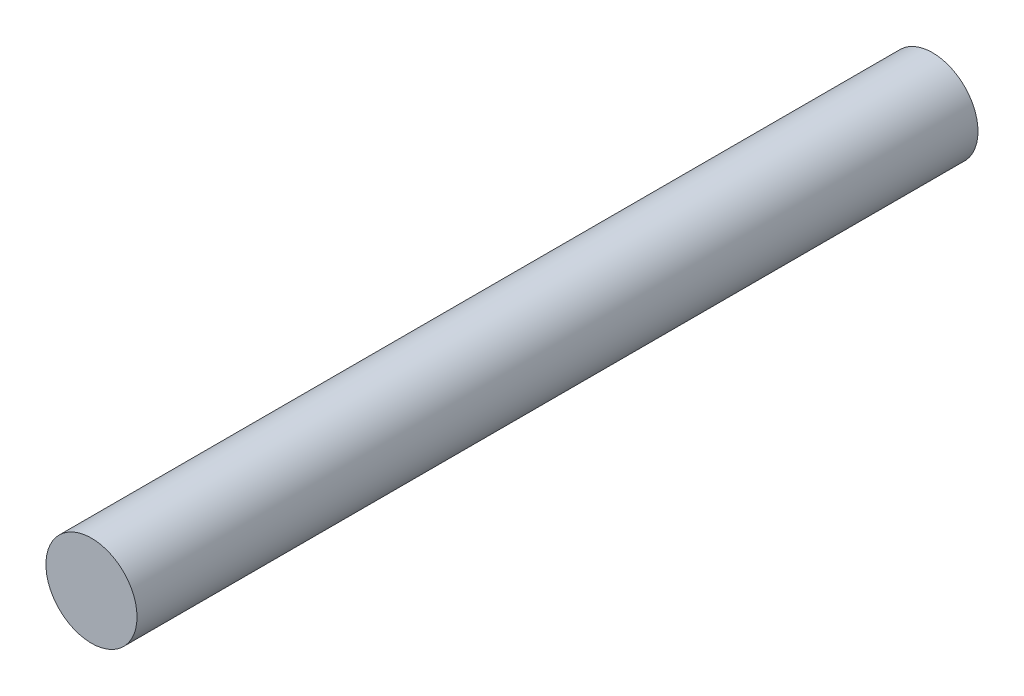
ISO-10303-21;
HEADER;
FILE_DESCRIPTION(('STEP AP214'),'2;1');
FILE_NAME('part.step','',(''),(''),'','','');
FILE_SCHEMA(('AUTOMOTIVE_DESIGN { 1 0 10303 214 1 1 1 1 }'));
ENDSEC;
DATA;
#1=APPLICATION_CONTEXT('core data for automotive mechanical design processes');
#2=APPLICATION_PROTOCOL_DEFINITION('international standard','automotive_design',2000,#1);
#3=PRODUCT_CONTEXT('',#1,'mechanical');
#4=PRODUCT('Part','Part','',(#3));
#5=PRODUCT_RELATED_PRODUCT_CATEGORY('part','',(#4));
#6=PRODUCT_DEFINITION_FORMATION('','',#4);
#7=PRODUCT_DEFINITION_CONTEXT('part definition',#1,'design');
#8=PRODUCT_DEFINITION('design','',#6,#7);
#9=PRODUCT_DEFINITION_SHAPE('','',#8);
#10=(LENGTH_UNIT() NAMED_UNIT(*) SI_UNIT(.MILLI.,.METRE.));
#11=(NAMED_UNIT(*) PLANE_ANGLE_UNIT() SI_UNIT($,.RADIAN.));
#12=(NAMED_UNIT(*) SI_UNIT($,.STERADIAN.) SOLID_ANGLE_UNIT());
#13=UNCERTAINTY_MEASURE_WITH_UNIT(LENGTH_MEASURE(1.E-05),#10,'distance_accuracy_value','');
#14=(GEOMETRIC_REPRESENTATION_CONTEXT(3) GLOBAL_UNCERTAINTY_ASSIGNED_CONTEXT((#13)) GLOBAL_UNIT_ASSIGNED_CONTEXT((#10,
#11,#12)) REPRESENTATION_CONTEXT('',''));
#15=CARTESIAN_POINT('',(0.,0.,0.));
#16=DIRECTION('',(0.,0.,1.));
#17=DIRECTION('',(1.,0.,0.));
#18=AXIS2_PLACEMENT_3D('',#15,#16,#17);
#19=CARTESIAN_POINT('',(0.,0.,60.));
#20=DIRECTION('',(0.,0.,-1.));
#21=DIRECTION('',(-1.,0.,0.));
#22=AXIS2_PLACEMENT_3D('',#19,#20,#21);
#23=CYLINDRICAL_SURFACE('',#22,6.5);
#24=CARTESIAN_POINT('',(0.,0.,60.));
#25=DIRECTION('',(0.,0.,1.));
#26=DIRECTION('',(1.,0.,0.));
#27=AXIS2_PLACEMENT_3D('',#24,#25,#26);
#28=CIRCLE('',#27,6.5);
#29=CARTESIAN_POINT('',(6.5,0.,60.));
#30=VERTEX_POINT('',#29);
#31=EDGE_CURVE('E10',#30,#30,#28,.T.);
#32=ORIENTED_EDGE('',*,*,#31,.F.);
#33=EDGE_LOOP('',(#32));
#34=FACE_BOUND('',#33,.T.);
#35=CARTESIAN_POINT('',(0.,0.,-60.));
#36=DIRECTION('',(0.,0.,1.));
#37=DIRECTION('',(1.,0.,0.));
#38=AXIS2_PLACEMENT_3D('',#35,#36,#37);
#39=CIRCLE('',#38,6.5);
#40=CARTESIAN_POINT('',(6.5,0.,-60.));
#41=VERTEX_POINT('',#40);
#42=EDGE_CURVE('E33',#41,#41,#39,.T.);
#43=ORIENTED_EDGE('',*,*,#42,.T.);
#44=EDGE_LOOP('',(#43));
#45=FACE_BOUND('',#44,.T.);
#46=ADVANCED_FACE('F30',(#34,#45),#23,.T.);
#47=CARTESIAN_POINT('',(0.,0.,60.));
#48=DIRECTION('',(0.,0.,1.));
#49=DIRECTION('',(1.,0.,0.));
#50=AXIS2_PLACEMENT_3D('',#47,#48,#49);
#51=PLANE('',#50);
#52=ORIENTED_EDGE('',*,*,#31,.T.);
#53=EDGE_LOOP('',(#52));
#54=FACE_BOUND('',#53,.T.);
#55=ADVANCED_FACE('F45',(#54),#51,.T.);
#56=CARTESIAN_POINT('',(0.,0.,-60.));
#57=DIRECTION('',(0.,0.,1.));
#58=DIRECTION('',(1.,0.,0.));
#59=AXIS2_PLACEMENT_3D('',#56,#57,#58);
#60=PLANE('',#59);
#61=ORIENTED_EDGE('',*,*,#42,.F.);
#62=EDGE_LOOP('',(#61));
#63=FACE_BOUND('',#62,.T.);
#64=ADVANCED_FACE('F43',(#63),#60,.F.);
#65=CLOSED_SHELL('',(#46,#55,#64));
#66=MANIFOLD_SOLID_BREP('B2',#65);
#67=ADVANCED_BREP_SHAPE_REPRESENTATION('',(#18,#66),#14);
#68=SHAPE_DEFINITION_REPRESENTATION(#9,#67);
ENDSEC;
END-ISO-10303-21;
